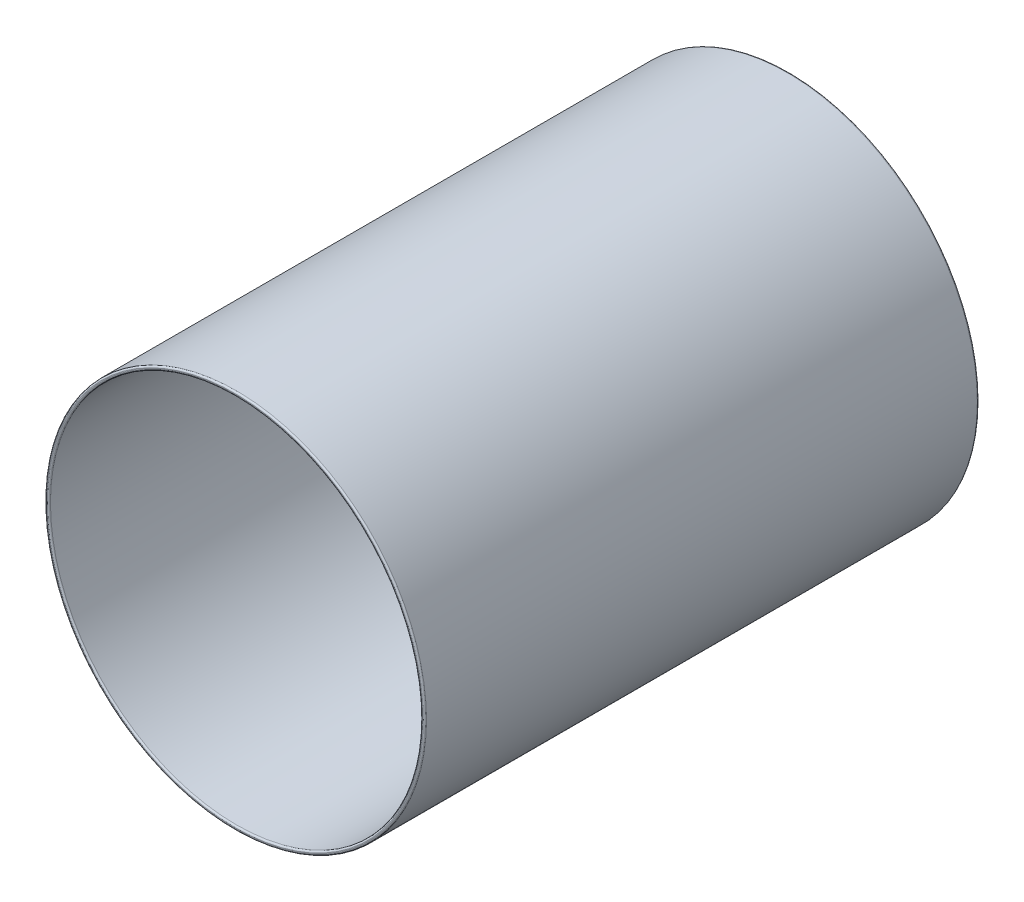
ISO-10303-21;
HEADER;
FILE_DESCRIPTION(('STEP AP214'),'2;1');
FILE_NAME('part.step','',(''),(''),'','','');
FILE_SCHEMA(('AUTOMOTIVE_DESIGN { 1 0 10303 214 1 1 1 1 }'));
ENDSEC;
DATA;
#1=APPLICATION_CONTEXT('core data for automotive mechanical design processes');
#2=APPLICATION_PROTOCOL_DEFINITION('international standard','automotive_design',2000,#1);
#3=PRODUCT_CONTEXT('',#1,'mechanical');
#4=PRODUCT('Part','Part','',(#3));
#5=PRODUCT_RELATED_PRODUCT_CATEGORY('part','',(#4));
#6=PRODUCT_DEFINITION_FORMATION('','',#4);
#7=PRODUCT_DEFINITION_CONTEXT('part definition',#1,'design');
#8=PRODUCT_DEFINITION('design','',#6,#7);
#9=PRODUCT_DEFINITION_SHAPE('','',#8);
#10=(LENGTH_UNIT() NAMED_UNIT(*) SI_UNIT(.MILLI.,.METRE.));
#11=(NAMED_UNIT(*) PLANE_ANGLE_UNIT() SI_UNIT($,.RADIAN.));
#12=(NAMED_UNIT(*) SI_UNIT($,.STERADIAN.) SOLID_ANGLE_UNIT());
#13=UNCERTAINTY_MEASURE_WITH_UNIT(LENGTH_MEASURE(1.E-05),#10,'distance_accuracy_value','');
#14=(GEOMETRIC_REPRESENTATION_CONTEXT(3) GLOBAL_UNCERTAINTY_ASSIGNED_CONTEXT((#13)) GLOBAL_UNIT_ASSIGNED_CONTEXT((#10,
#11,#12)) REPRESENTATION_CONTEXT('',''));
#15=CARTESIAN_POINT('',(0.,0.,0.));
#16=DIRECTION('',(0.,0.,1.));
#17=DIRECTION('',(1.,0.,0.));
#18=AXIS2_PLACEMENT_3D('',#15,#16,#17);
#19=CARTESIAN_POINT('',(0.,0.,-700.));
#20=DIRECTION('',(0.,0.,1.));
#21=DIRECTION('',(1.,0.,0.));
#22=AXIS2_PLACEMENT_3D('',#19,#20,#21);
#23=CYLINDRICAL_SURFACE('',#22,240.);
#24=CARTESIAN_POINT('',(0.,0.,-698.));
#25=DIRECTION('',(0.,0.,1.));
#26=DIRECTION('',(1.,0.,0.));
#27=AXIS2_PLACEMENT_3D('',#24,#25,#26);
#28=CIRCLE('',#27,240.);
#29=CARTESIAN_POINT('',(240.,0.,-698.));
#30=VERTEX_POINT('',#29);
#31=EDGE_CURVE('E45',#30,#30,#28,.T.);
#32=ORIENTED_EDGE('',*,*,#31,.T.);
#33=EDGE_LOOP('',(#32));
#34=FACE_BOUND('',#33,.T.);
#35=CARTESIAN_POINT('',(0.,0.,-2.));
#36=DIRECTION('',(0.,0.,1.));
#37=DIRECTION('',(1.,0.,0.));
#38=AXIS2_PLACEMENT_3D('',#35,#36,#37);
#39=CIRCLE('',#38,240.);
#40=CARTESIAN_POINT('',(240.,0.,-2.));
#41=VERTEX_POINT('',#40);
#42=EDGE_CURVE('E49',#41,#41,#39,.F.);
#43=ORIENTED_EDGE('',*,*,#42,.T.);
#44=EDGE_LOOP('',(#43));
#45=FACE_BOUND('',#44,.T.);
#46=ADVANCED_FACE('F34',(#34,#45),#23,.T.);
#47=CARTESIAN_POINT('',(0.,0.,-700.));
#48=DIRECTION('',(0.,0.,1.));
#49=DIRECTION('',(1.,0.,0.));
#50=AXIS2_PLACEMENT_3D('',#47,#48,#49);
#51=PLANE('',#50);
#52=CARTESIAN_POINT('',(0.,0.,-700.));
#53=DIRECTION('',(0.,0.,1.));
#54=DIRECTION('',(1.,0.,0.));
#55=AXIS2_PLACEMENT_3D('',#52,#53,#54);
#56=CIRCLE('',#55,237.);
#57=CARTESIAN_POINT('',(237.,0.,-700.));
#58=VERTEX_POINT('',#57);
#59=EDGE_CURVE('E60',#58,#58,#56,.T.);
#60=ORIENTED_EDGE('',*,*,#59,.T.);
#61=EDGE_LOOP('',(#60));
#62=FACE_BOUND('',#61,.T.);
#63=CARTESIAN_POINT('',(0.,0.,-700.));
#64=DIRECTION('',(0.,0.,1.));
#65=DIRECTION('',(1.,0.,0.));
#66=AXIS2_PLACEMENT_3D('',#63,#64,#65);
#67=CIRCLE('',#66,238.);
#68=CARTESIAN_POINT('',(238.,0.,-700.));
#69=VERTEX_POINT('',#68);
#70=EDGE_CURVE('E63',#69,#69,#67,.F.);
#71=ORIENTED_EDGE('',*,*,#70,.T.);
#72=EDGE_LOOP('',(#71));
#73=FACE_BOUND('',#72,.T.);
#74=ADVANCED_FACE('F67',(#62,#73),#51,.F.);
#75=CARTESIAN_POINT('',(0.,0.,0.));
#76=DIRECTION('',(0.,0.,1.));
#77=DIRECTION('',(1.,0.,0.));
#78=AXIS2_PLACEMENT_3D('',#75,#76,#77);
#79=PLANE('',#78);
#80=CARTESIAN_POINT('',(0.,0.,0.));
#81=DIRECTION('',(0.,0.,1.));
#82=DIRECTION('',(1.,0.,0.));
#83=AXIS2_PLACEMENT_3D('',#80,#81,#82);
#84=CIRCLE('',#83,237.);
#85=CARTESIAN_POINT('',(237.,0.,0.));
#86=VERTEX_POINT('',#85);
#87=EDGE_CURVE('E10',#86,#86,#84,.F.);
#88=ORIENTED_EDGE('',*,*,#87,.T.);
#89=EDGE_LOOP('',(#88));
#90=FACE_BOUND('',#89,.T.);
#91=CARTESIAN_POINT('',(0.,0.,0.));
#92=DIRECTION('',(0.,0.,1.));
#93=DIRECTION('',(1.,0.,0.));
#94=AXIS2_PLACEMENT_3D('',#91,#92,#93);
#95=CIRCLE('',#94,238.);
#96=CARTESIAN_POINT('',(238.,0.,0.));
#97=VERTEX_POINT('',#96);
#98=EDGE_CURVE('E41',#97,#97,#95,.T.);
#99=ORIENTED_EDGE('',*,*,#98,.T.);
#100=EDGE_LOOP('',(#99));
#101=FACE_BOUND('',#100,.T.);
#102=ADVANCED_FACE('F96',(#90,#101),#79,.T.);
#103=CARTESIAN_POINT('',(0.,0.,-700.));
#104=DIRECTION('',(0.,0.,1.));
#105=DIRECTION('',(1.,0.,0.));
#106=AXIS2_PLACEMENT_3D('',#103,#104,#105);
#107=CYLINDRICAL_SURFACE('',#106,235.);
#108=CARTESIAN_POINT('',(0.,0.,-698.));
#109=DIRECTION('',(0.,0.,1.));
#110=DIRECTION('',(1.,0.,0.));
#111=AXIS2_PLACEMENT_3D('',#108,#109,#110);
#112=CIRCLE('',#111,235.);
#113=CARTESIAN_POINT('',(235.,0.,-698.));
#114=VERTEX_POINT('',#113);
#115=EDGE_CURVE('E54',#114,#114,#112,.F.);
#116=ORIENTED_EDGE('',*,*,#115,.T.);
#117=EDGE_LOOP('',(#116));
#118=FACE_BOUND('',#117,.T.);
#119=CARTESIAN_POINT('',(0.,0.,-2.));
#120=DIRECTION('',(0.,0.,1.));
#121=DIRECTION('',(1.,0.,0.));
#122=AXIS2_PLACEMENT_3D('',#119,#120,#121);
#123=CIRCLE('',#122,235.);
#124=CARTESIAN_POINT('',(235.,0.,-2.));
#125=VERTEX_POINT('',#124);
#126=EDGE_CURVE('E57',#125,#125,#123,.T.);
#127=ORIENTED_EDGE('',*,*,#126,.T.);
#128=EDGE_LOOP('',(#127));
#129=FACE_BOUND('',#128,.T.);
#130=ADVANCED_FACE('F93',(#118,#129),#107,.F.);
#131=CARTESIAN_POINT('',(0.,0.,-698.));
#132=DIRECTION('',(0.,0.,1.));
#133=DIRECTION('',(1.,0.,0.));
#134=AXIS2_PLACEMENT_3D('',#131,#132,#133);
#135=TOROIDAL_SURFACE('',#134,237.,2.);
#136=ORIENTED_EDGE('',*,*,#115,.F.);
#137=EDGE_LOOP('',(#136));
#138=FACE_BOUND('',#137,.T.);
#139=ORIENTED_EDGE('',*,*,#59,.F.);
#140=EDGE_LOOP('',(#139));
#141=FACE_BOUND('',#140,.T.);
#142=ADVANCED_FACE('F73',(#138,#141),#135,.T.);
#143=CARTESIAN_POINT('',(0.,0.,-698.));
#144=DIRECTION('',(0.,0.,1.));
#145=DIRECTION('',(1.,0.,0.));
#146=AXIS2_PLACEMENT_3D('',#143,#144,#145);
#147=TOROIDAL_SURFACE('',#146,238.,2.);
#148=ORIENTED_EDGE('',*,*,#70,.F.);
#149=EDGE_LOOP('',(#148));
#150=FACE_BOUND('',#149,.T.);
#151=ORIENTED_EDGE('',*,*,#31,.F.);
#152=EDGE_LOOP('',(#151));
#153=FACE_BOUND('',#152,.T.);
#154=ADVANCED_FACE('F69',(#150,#153),#147,.T.);
#155=CARTESIAN_POINT('',(0.,0.,-2.));
#156=DIRECTION('',(0.,0.,1.));
#157=DIRECTION('',(1.,0.,0.));
#158=AXIS2_PLACEMENT_3D('',#155,#156,#157);
#159=TOROIDAL_SURFACE('',#158,237.,2.);
#160=ORIENTED_EDGE('',*,*,#87,.F.);
#161=EDGE_LOOP('',(#160));
#162=FACE_BOUND('',#161,.T.);
#163=ORIENTED_EDGE('',*,*,#126,.F.);
#164=EDGE_LOOP('',(#163));
#165=FACE_BOUND('',#164,.T.);
#166=ADVANCED_FACE('F72',(#162,#165),#159,.T.);
#167=CARTESIAN_POINT('',(0.,0.,-2.));
#168=DIRECTION('',(0.,0.,1.));
#169=DIRECTION('',(1.,0.,0.));
#170=AXIS2_PLACEMENT_3D('',#167,#168,#169);
#171=TOROIDAL_SURFACE('',#170,238.,2.);
#172=ORIENTED_EDGE('',*,*,#42,.F.);
#173=EDGE_LOOP('',(#172));
#174=FACE_BOUND('',#173,.T.);
#175=ORIENTED_EDGE('',*,*,#98,.F.);
#176=EDGE_LOOP('',(#175));
#177=FACE_BOUND('',#176,.T.);
#178=ADVANCED_FACE('F36',(#174,#177),#171,.T.);
#179=CLOSED_SHELL('',(#46,#74,#102,#130,#142,#154,#166,#178));
#180=MANIFOLD_SOLID_BREP('B2',#179);
#181=ADVANCED_BREP_SHAPE_REPRESENTATION('',(#18,#180),#14);
#182=SHAPE_DEFINITION_REPRESENTATION(#9,#181);
ENDSEC;
END-ISO-10303-21;
